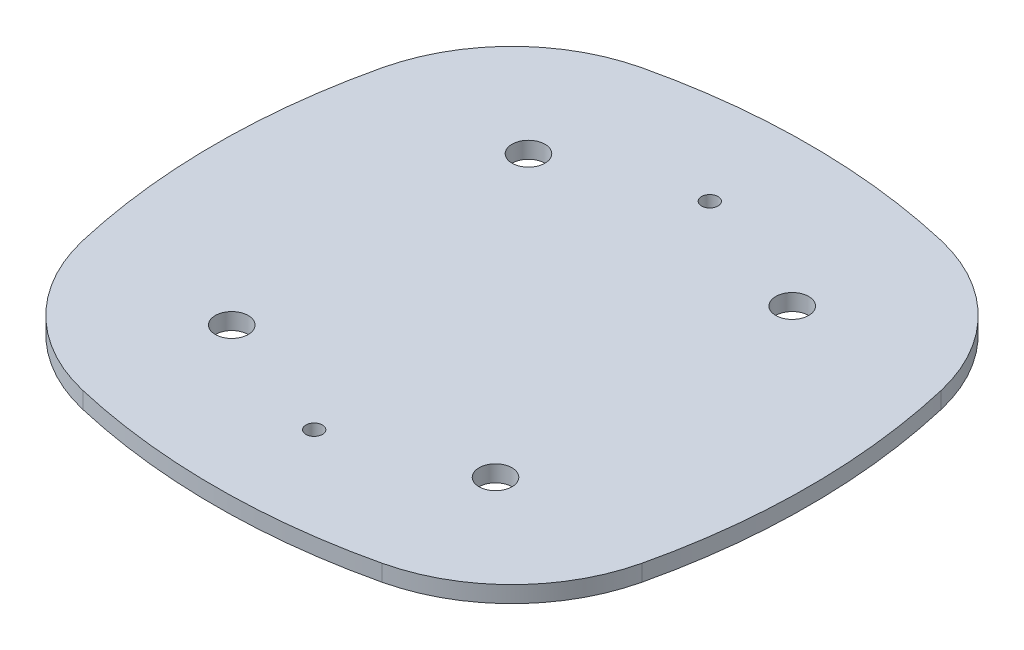
ISO-10303-21;
HEADER;
FILE_DESCRIPTION(('STEP AP214'),'2;1');
FILE_NAME('part.step','',(''),(''),'','','');
FILE_SCHEMA(('AUTOMOTIVE_DESIGN { 1 0 10303 214 1 1 1 1 }'));
ENDSEC;
DATA;
#1=APPLICATION_CONTEXT('core data for automotive mechanical design processes');
#2=APPLICATION_PROTOCOL_DEFINITION('international standard','automotive_design',2000,#1);
#3=PRODUCT_CONTEXT('',#1,'mechanical');
#4=PRODUCT('Part','Part','',(#3));
#5=PRODUCT_RELATED_PRODUCT_CATEGORY('part','',(#4));
#6=PRODUCT_DEFINITION_FORMATION('','',#4);
#7=PRODUCT_DEFINITION_CONTEXT('part definition',#1,'design');
#8=PRODUCT_DEFINITION('design','',#6,#7);
#9=PRODUCT_DEFINITION_SHAPE('','',#8);
#10=(LENGTH_UNIT() NAMED_UNIT(*) SI_UNIT(.MILLI.,.METRE.));
#11=(NAMED_UNIT(*) PLANE_ANGLE_UNIT() SI_UNIT($,.RADIAN.));
#12=(NAMED_UNIT(*) SI_UNIT($,.STERADIAN.) SOLID_ANGLE_UNIT());
#13=UNCERTAINTY_MEASURE_WITH_UNIT(LENGTH_MEASURE(1.E-05),#10,'distance_accuracy_value','');
#14=(GEOMETRIC_REPRESENTATION_CONTEXT(3) GLOBAL_UNCERTAINTY_ASSIGNED_CONTEXT((#13)) GLOBAL_UNIT_ASSIGNED_CONTEXT((#10,
#11,#12)) REPRESENTATION_CONTEXT('',''));
#15=CARTESIAN_POINT('',(0.,0.,0.));
#16=DIRECTION('',(0.,0.,1.));
#17=DIRECTION('',(1.,0.,0.));
#18=AXIS2_PLACEMENT_3D('',#15,#16,#17);
#19=CARTESIAN_POINT('',(-3.82916187310649,0.5,1.67083812689351));
#20=DIRECTION('',(0.,1.,0.));
#21=DIRECTION('',(0.,0.,1.));
#22=AXIS2_PLACEMENT_3D('',#19,#20,#21);
#23=PLANE('',#22);
#24=CARTESIAN_POINT('',(0.,0.5,-6.));
#25=DIRECTION('',(0.,1.,0.));
#26=DIRECTION('',(0.,0.,1.));
#27=AXIS2_PLACEMENT_3D('',#24,#25,#26);
#28=CIRCLE('',#27,0.25);
#29=CARTESIAN_POINT('',(0.,0.5,-5.75));
#30=VERTEX_POINT('',#29);
#31=EDGE_CURVE('E199',#30,#30,#28,.T.);
#32=ORIENTED_EDGE('',*,*,#31,.F.);
#33=EDGE_LOOP('',(#32));
#34=FACE_BOUND('',#33,.T.);
#35=CARTESIAN_POINT('',(4.,0.5,4.5));
#36=DIRECTION('',(0.,1.,0.));
#37=DIRECTION('',(0.,0.,1.));
#38=AXIS2_PLACEMENT_3D('',#35,#36,#37);
#39=CIRCLE('',#38,0.5);
#40=CARTESIAN_POINT('',(4.,0.5,5.));
#41=VERTEX_POINT('',#40);
#42=EDGE_CURVE('E187',#41,#41,#39,.T.);
#43=ORIENTED_EDGE('',*,*,#42,.F.);
#44=EDGE_LOOP('',(#43));
#45=FACE_BOUND('',#44,.T.);
#46=CARTESIAN_POINT('',(4.,0.5,-4.5));
#47=DIRECTION('',(0.,1.,0.));
#48=DIRECTION('',(0.,0.,1.));
#49=AXIS2_PLACEMENT_3D('',#46,#47,#48);
#50=CIRCLE('',#49,0.5);
#51=CARTESIAN_POINT('',(4.,0.5,-4.));
#52=VERTEX_POINT('',#51);
#53=EDGE_CURVE('E133',#52,#52,#50,.T.);
#54=ORIENTED_EDGE('',*,*,#53,.F.);
#55=EDGE_LOOP('',(#54));
#56=FACE_BOUND('',#55,.T.);
#57=CARTESIAN_POINT('',(3.34167625378701,0.5,3.34167625378702));
#58=DIRECTION('',(0.,1.,0.));
#59=DIRECTION('',(0.,0.,1.));
#60=AXIS2_PLACEMENT_3D('',#57,#58,#59);
#61=CIRCLE('',#60,5.27415612083428);
#62=CARTESIAN_POINT('',(4.53851919279799,0.5,8.47824025769793));
#63=VERTEX_POINT('',#62);
#64=CARTESIAN_POINT('',(8.47824025769793,0.5,4.53851919279798));
#65=VERTEX_POINT('',#64);
#66=EDGE_CURVE('E144',#63,#65,#61,.T.);
#67=ORIENTED_EDGE('',*,*,#66,.T.);
#68=CARTESIAN_POINT('',(-11.,0.5,0.));
#69=DIRECTION('',(0.,1.,0.));
#70=DIRECTION('',(0.,0.,1.));
#71=AXIS2_PLACEMENT_3D('',#68,#69,#70);
#72=CIRCLE('',#71,20.);
#73=CARTESIAN_POINT('',(8.47824025769793,0.5,-4.53851919279798));
#74=VERTEX_POINT('',#73);
#75=EDGE_CURVE('E92',#65,#74,#72,.T.);
#76=ORIENTED_EDGE('',*,*,#75,.T.);
#77=CARTESIAN_POINT('',(3.34167625378702,0.5,-3.34167625378701));
#78=DIRECTION('',(0.,1.,0.));
#79=DIRECTION('',(0.,0.,1.));
#80=AXIS2_PLACEMENT_3D('',#77,#78,#79);
#81=CIRCLE('',#80,5.27415612083428);
#82=CARTESIAN_POINT('',(4.53851919279798,0.5,-8.47824025769793));
#83=VERTEX_POINT('',#82);
#84=EDGE_CURVE('E159',#74,#83,#81,.T.);
#85=ORIENTED_EDGE('',*,*,#84,.T.);
#86=CARTESIAN_POINT('',(0.,0.5,11.));
#87=DIRECTION('',(0.,1.,0.));
#88=DIRECTION('',(0.,0.,1.));
#89=AXIS2_PLACEMENT_3D('',#86,#87,#88);
#90=CIRCLE('',#89,20.);
#91=CARTESIAN_POINT('',(-4.53851919279798,0.5,-8.47824025769793));
#92=VERTEX_POINT('',#91);
#93=EDGE_CURVE('E172',#83,#92,#90,.T.);
#94=ORIENTED_EDGE('',*,*,#93,.T.);
#95=CARTESIAN_POINT('',(-3.34167625378702,0.5,-3.34167625378701));
#96=DIRECTION('',(0.,1.,0.));
#97=DIRECTION('',(0.,0.,1.));
#98=AXIS2_PLACEMENT_3D('',#95,#96,#97);
#99=CIRCLE('',#98,5.27415612083428);
#100=CARTESIAN_POINT('',(-8.47824025769793,0.5,-4.53851919279798));
#101=VERTEX_POINT('',#100);
#102=EDGE_CURVE('E111',#92,#101,#99,.T.);
#103=ORIENTED_EDGE('',*,*,#102,.T.);
#104=CARTESIAN_POINT('',(11.,0.5,0.));
#105=DIRECTION('',(0.,1.,0.));
#106=DIRECTION('',(0.,0.,1.));
#107=AXIS2_PLACEMENT_3D('',#104,#105,#106);
#108=CIRCLE('',#107,20.);
#109=CARTESIAN_POINT('',(-8.47824025769792,0.5,4.538519192798));
#110=VERTEX_POINT('',#109);
#111=EDGE_CURVE('E105',#101,#110,#108,.T.);
#112=ORIENTED_EDGE('',*,*,#111,.T.);
#113=CARTESIAN_POINT('',(-3.34167625378704,0.5,3.34167625378705));
#114=DIRECTION('',(0.,1.,0.));
#115=DIRECTION('',(0.,0.,1.));
#116=AXIS2_PLACEMENT_3D('',#113,#114,#115);
#117=CIRCLE('',#116,5.27415612083425);
#118=CARTESIAN_POINT('',(-4.53851919279801,0.5,8.47824025769793));
#119=VERTEX_POINT('',#118);
#120=EDGE_CURVE('E109',#110,#119,#117,.T.);
#121=ORIENTED_EDGE('',*,*,#120,.T.);
#122=CARTESIAN_POINT('',(0.,0.5,-11.));
#123=DIRECTION('',(0.,1.,0.));
#124=DIRECTION('',(0.,0.,1.));
#125=AXIS2_PLACEMENT_3D('',#122,#123,#124);
#126=CIRCLE('',#125,20.);
#127=EDGE_CURVE('E49',#119,#63,#126,.T.);
#128=ORIENTED_EDGE('',*,*,#127,.T.);
#129=EDGE_LOOP('',(#67,#76,#85,#94,#103,#112,#121,#128));
#130=FACE_BOUND('',#129,.T.);
#131=CARTESIAN_POINT('',(-4.,0.5,-4.5));
#132=DIRECTION('',(0.,1.,0.));
#133=DIRECTION('',(0.,0.,1.));
#134=AXIS2_PLACEMENT_3D('',#131,#132,#133);
#135=CIRCLE('',#134,0.5);
#136=CARTESIAN_POINT('',(-4.,0.5,-4.));
#137=VERTEX_POINT('',#136);
#138=EDGE_CURVE('E181',#137,#137,#135,.T.);
#139=ORIENTED_EDGE('',*,*,#138,.F.);
#140=EDGE_LOOP('',(#139));
#141=FACE_BOUND('',#140,.T.);
#142=CARTESIAN_POINT('',(-4.,0.5,4.5));
#143=DIRECTION('',(0.,1.,0.));
#144=DIRECTION('',(0.,0.,1.));
#145=AXIS2_PLACEMENT_3D('',#142,#143,#144);
#146=CIRCLE('',#145,0.5);
#147=CARTESIAN_POINT('',(-4.,0.5,5.));
#148=VERTEX_POINT('',#147);
#149=EDGE_CURVE('E193',#148,#148,#146,.T.);
#150=ORIENTED_EDGE('',*,*,#149,.F.);
#151=EDGE_LOOP('',(#150));
#152=FACE_BOUND('',#151,.T.);
#153=CARTESIAN_POINT('',(0.,0.5,6.));
#154=DIRECTION('',(0.,1.,0.));
#155=DIRECTION('',(0.,0.,1.));
#156=AXIS2_PLACEMENT_3D('',#153,#154,#155);
#157=CIRCLE('',#156,0.25);
#158=CARTESIAN_POINT('',(0.,0.5,6.25));
#159=VERTEX_POINT('',#158);
#160=EDGE_CURVE('E205',#159,#159,#157,.T.);
#161=ORIENTED_EDGE('',*,*,#160,.F.);
#162=EDGE_LOOP('',(#161));
#163=FACE_BOUND('',#162,.T.);
#164=ADVANCED_FACE('F32',(#34,#45,#56,#130,#141,#152,#163),#23,.T.);
#165=CARTESIAN_POINT('',(-3.82916187310649,0.,1.67083812689351));
#166=DIRECTION('',(0.,1.,0.));
#167=DIRECTION('',(0.,0.,1.));
#168=AXIS2_PLACEMENT_3D('',#165,#166,#167);
#169=PLANE('',#168);
#170=CARTESIAN_POINT('',(0.,0.,-6.));
#171=DIRECTION('',(0.,1.,0.));
#172=DIRECTION('',(0.,0.,1.));
#173=AXIS2_PLACEMENT_3D('',#170,#171,#172);
#174=CIRCLE('',#173,0.25);
#175=CARTESIAN_POINT('',(0.,0.,-5.75));
#176=VERTEX_POINT('',#175);
#177=EDGE_CURVE('E202',#176,#176,#174,.T.);
#178=ORIENTED_EDGE('',*,*,#177,.T.);
#179=EDGE_LOOP('',(#178));
#180=FACE_BOUND('',#179,.T.);
#181=CARTESIAN_POINT('',(4.,0.,4.5));
#182=DIRECTION('',(0.,1.,0.));
#183=DIRECTION('',(0.,0.,1.));
#184=AXIS2_PLACEMENT_3D('',#181,#182,#183);
#185=CIRCLE('',#184,0.5);
#186=CARTESIAN_POINT('',(4.,0.,5.));
#187=VERTEX_POINT('',#186);
#188=EDGE_CURVE('E190',#187,#187,#185,.T.);
#189=ORIENTED_EDGE('',*,*,#188,.T.);
#190=EDGE_LOOP('',(#189));
#191=FACE_BOUND('',#190,.T.);
#192=CARTESIAN_POINT('',(4.,0.,-4.5));
#193=DIRECTION('',(0.,1.,0.));
#194=DIRECTION('',(0.,0.,1.));
#195=AXIS2_PLACEMENT_3D('',#192,#193,#194);
#196=CIRCLE('',#195,0.5);
#197=CARTESIAN_POINT('',(4.,0.,-4.));
#198=VERTEX_POINT('',#197);
#199=EDGE_CURVE('E178',#198,#198,#196,.T.);
#200=ORIENTED_EDGE('',*,*,#199,.T.);
#201=EDGE_LOOP('',(#200));
#202=FACE_BOUND('',#201,.T.);
#203=CARTESIAN_POINT('',(3.34167625378701,0.,3.34167625378702));
#204=DIRECTION('',(0.,1.,0.));
#205=DIRECTION('',(0.,0.,1.));
#206=AXIS2_PLACEMENT_3D('',#203,#204,#205);
#207=CIRCLE('',#206,5.27415612083428);
#208=CARTESIAN_POINT('',(4.53851919279799,0.,8.47824025769793));
#209=VERTEX_POINT('',#208);
#210=CARTESIAN_POINT('',(8.47824025769793,0.,4.53851919279798));
#211=VERTEX_POINT('',#210);
#212=EDGE_CURVE('E129',#209,#211,#207,.T.);
#213=ORIENTED_EDGE('',*,*,#212,.F.);
#214=CARTESIAN_POINT('',(0.,0.,-11.));
#215=DIRECTION('',(0.,1.,0.));
#216=DIRECTION('',(0.,0.,1.));
#217=AXIS2_PLACEMENT_3D('',#214,#215,#216);
#218=CIRCLE('',#217,20.);
#219=CARTESIAN_POINT('',(-4.53851919279801,0.,8.47824025769793));
#220=VERTEX_POINT('',#219);
#221=EDGE_CURVE('E84',#220,#209,#218,.T.);
#222=ORIENTED_EDGE('',*,*,#221,.F.);
#223=CARTESIAN_POINT('',(-3.34167625378704,0.,3.34167625378705));
#224=DIRECTION('',(0.,1.,0.));
#225=DIRECTION('',(0.,0.,1.));
#226=AXIS2_PLACEMENT_3D('',#223,#224,#225);
#227=CIRCLE('',#226,5.27415612083425);
#228=CARTESIAN_POINT('',(-8.47824025769792,0.,4.538519192798));
#229=VERTEX_POINT('',#228);
#230=EDGE_CURVE('E78',#229,#220,#227,.T.);
#231=ORIENTED_EDGE('',*,*,#230,.F.);
#232=CARTESIAN_POINT('',(11.,0.,0.));
#233=DIRECTION('',(0.,1.,0.));
#234=DIRECTION('',(0.,0.,1.));
#235=AXIS2_PLACEMENT_3D('',#232,#233,#234);
#236=CIRCLE('',#235,20.);
#237=CARTESIAN_POINT('',(-8.47824025769793,0.,-4.53851919279798));
#238=VERTEX_POINT('',#237);
#239=EDGE_CURVE('E119',#238,#229,#236,.T.);
#240=ORIENTED_EDGE('',*,*,#239,.F.);
#241=CARTESIAN_POINT('',(-3.34167625378702,0.,-3.34167625378701));
#242=DIRECTION('',(0.,1.,0.));
#243=DIRECTION('',(0.,0.,1.));
#244=AXIS2_PLACEMENT_3D('',#241,#242,#243);
#245=CIRCLE('',#244,5.27415612083428);
#246=CARTESIAN_POINT('',(-4.53851919279798,0.,-8.47824025769793));
#247=VERTEX_POINT('',#246);
#248=EDGE_CURVE('E139',#247,#238,#245,.T.);
#249=ORIENTED_EDGE('',*,*,#248,.F.);
#250=CARTESIAN_POINT('',(0.,0.,11.));
#251=DIRECTION('',(0.,1.,0.));
#252=DIRECTION('',(0.,0.,1.));
#253=AXIS2_PLACEMENT_3D('',#250,#251,#252);
#254=CIRCLE('',#253,20.);
#255=CARTESIAN_POINT('',(4.53851919279798,0.,-8.47824025769793));
#256=VERTEX_POINT('',#255);
#257=EDGE_CURVE('E137',#256,#247,#254,.T.);
#258=ORIENTED_EDGE('',*,*,#257,.F.);
#259=CARTESIAN_POINT('',(3.34167625378702,0.,-3.34167625378701));
#260=DIRECTION('',(0.,1.,0.));
#261=DIRECTION('',(0.,0.,1.));
#262=AXIS2_PLACEMENT_3D('',#259,#260,#261);
#263=CIRCLE('',#262,5.27415612083428);
#264=CARTESIAN_POINT('',(8.47824025769793,0.,-4.53851919279798));
#265=VERTEX_POINT('',#264);
#266=EDGE_CURVE('E135',#265,#256,#263,.T.);
#267=ORIENTED_EDGE('',*,*,#266,.F.);
#268=CARTESIAN_POINT('',(-11.,0.,0.));
#269=DIRECTION('',(0.,1.,0.));
#270=DIRECTION('',(0.,0.,1.));
#271=AXIS2_PLACEMENT_3D('',#268,#269,#270);
#272=CIRCLE('',#271,20.);
#273=EDGE_CURVE('E132',#211,#265,#272,.T.);
#274=ORIENTED_EDGE('',*,*,#273,.F.);
#275=EDGE_LOOP('',(#213,#222,#231,#240,#249,#258,#267,#274));
#276=FACE_BOUND('',#275,.T.);
#277=CARTESIAN_POINT('',(-4.,0.,-4.5));
#278=DIRECTION('',(0.,1.,0.));
#279=DIRECTION('',(0.,0.,1.));
#280=AXIS2_PLACEMENT_3D('',#277,#278,#279);
#281=CIRCLE('',#280,0.5);
#282=CARTESIAN_POINT('',(-4.,0.,-4.));
#283=VERTEX_POINT('',#282);
#284=EDGE_CURVE('E184',#283,#283,#281,.T.);
#285=ORIENTED_EDGE('',*,*,#284,.T.);
#286=EDGE_LOOP('',(#285));
#287=FACE_BOUND('',#286,.T.);
#288=CARTESIAN_POINT('',(-4.,0.,4.5));
#289=DIRECTION('',(0.,1.,0.));
#290=DIRECTION('',(0.,0.,1.));
#291=AXIS2_PLACEMENT_3D('',#288,#289,#290);
#292=CIRCLE('',#291,0.5);
#293=CARTESIAN_POINT('',(-4.,0.,5.));
#294=VERTEX_POINT('',#293);
#295=EDGE_CURVE('E196',#294,#294,#292,.T.);
#296=ORIENTED_EDGE('',*,*,#295,.T.);
#297=EDGE_LOOP('',(#296));
#298=FACE_BOUND('',#297,.T.);
#299=CARTESIAN_POINT('',(0.,0.,6.));
#300=DIRECTION('',(0.,1.,0.));
#301=DIRECTION('',(0.,0.,1.));
#302=AXIS2_PLACEMENT_3D('',#299,#300,#301);
#303=CIRCLE('',#302,0.25);
#304=CARTESIAN_POINT('',(0.,0.,6.25));
#305=VERTEX_POINT('',#304);
#306=EDGE_CURVE('E208',#305,#305,#303,.T.);
#307=ORIENTED_EDGE('',*,*,#306,.T.);
#308=EDGE_LOOP('',(#307));
#309=FACE_BOUND('',#308,.T.);
#310=ADVANCED_FACE('F163',(#180,#191,#202,#276,#287,#298,#309),#169,.F.);
#311=CARTESIAN_POINT('',(3.34167625378701,0.5,3.34167625378702));
#312=DIRECTION('',(0.,-1.,0.));
#313=DIRECTION('',(0.,0.,-1.));
#314=AXIS2_PLACEMENT_3D('',#311,#312,#313);
#315=CYLINDRICAL_SURFACE('',#314,5.27415612083428);
#316=ORIENTED_EDGE('',*,*,#212,.T.);
#317=DIRECTION('',(0.,-1.,0.));
#318=VECTOR('',#317,1.);
#319=CARTESIAN_POINT('',(8.47824025769793,0.5,4.53851919279798));
#320=LINE('',#319,#318);
#321=EDGE_CURVE('E11',#65,#211,#320,.T.);
#322=ORIENTED_EDGE('',*,*,#321,.F.);
#323=ORIENTED_EDGE('',*,*,#66,.F.);
#324=DIRECTION('',(0.,-1.,0.));
#325=VECTOR('',#324,1.);
#326=CARTESIAN_POINT('',(4.53851919279799,0.5,8.47824025769793));
#327=LINE('',#326,#325);
#328=EDGE_CURVE('E125',#63,#209,#327,.T.);
#329=ORIENTED_EDGE('',*,*,#328,.T.);
#330=EDGE_LOOP('',(#316,#322,#323,#329));
#331=FACE_BOUND('',#330,.T.);
#332=ADVANCED_FACE('F34',(#331),#315,.T.);
#333=CARTESIAN_POINT('',(-11.,0.5,0.));
#334=DIRECTION('',(0.,-1.,0.));
#335=DIRECTION('',(0.,0.,-1.));
#336=AXIS2_PLACEMENT_3D('',#333,#334,#335);
#337=CYLINDRICAL_SURFACE('',#336,20.);
#338=ORIENTED_EDGE('',*,*,#273,.T.);
#339=DIRECTION('',(0.,-1.,0.));
#340=VECTOR('',#339,1.);
#341=CARTESIAN_POINT('',(8.47824025769793,0.5,-4.53851919279798));
#342=LINE('',#341,#340);
#343=EDGE_CURVE('E41',#74,#265,#342,.T.);
#344=ORIENTED_EDGE('',*,*,#343,.F.);
#345=ORIENTED_EDGE('',*,*,#75,.F.);
#346=ORIENTED_EDGE('',*,*,#321,.T.);
#347=EDGE_LOOP('',(#338,#344,#345,#346));
#348=FACE_BOUND('',#347,.T.);
#349=ADVANCED_FACE('F243',(#348),#337,.T.);
#350=CARTESIAN_POINT('',(3.34167625378702,0.5,-3.34167625378701));
#351=DIRECTION('',(0.,-1.,0.));
#352=DIRECTION('',(0.,0.,-1.));
#353=AXIS2_PLACEMENT_3D('',#350,#351,#352);
#354=CYLINDRICAL_SURFACE('',#353,5.27415612083428);
#355=ORIENTED_EDGE('',*,*,#266,.T.);
#356=DIRECTION('',(0.,-1.,0.));
#357=VECTOR('',#356,1.);
#358=CARTESIAN_POINT('',(4.53851919279798,0.5,-8.47824025769793));
#359=LINE('',#358,#357);
#360=EDGE_CURVE('E151',#83,#256,#359,.T.);
#361=ORIENTED_EDGE('',*,*,#360,.F.);
#362=ORIENTED_EDGE('',*,*,#84,.F.);
#363=ORIENTED_EDGE('',*,*,#343,.T.);
#364=EDGE_LOOP('',(#355,#361,#362,#363));
#365=FACE_BOUND('',#364,.T.);
#366=ADVANCED_FACE('F157',(#365),#354,.T.);
#367=CARTESIAN_POINT('',(0.,0.5,11.));
#368=DIRECTION('',(0.,-1.,0.));
#369=DIRECTION('',(0.,0.,-1.));
#370=AXIS2_PLACEMENT_3D('',#367,#368,#369);
#371=CYLINDRICAL_SURFACE('',#370,20.);
#372=ORIENTED_EDGE('',*,*,#257,.T.);
#373=DIRECTION('',(0.,-1.,0.));
#374=VECTOR('',#373,1.);
#375=CARTESIAN_POINT('',(-4.53851919279798,0.5,-8.47824025769793));
#376=LINE('',#375,#374);
#377=EDGE_CURVE('E148',#92,#247,#376,.T.);
#378=ORIENTED_EDGE('',*,*,#377,.F.);
#379=ORIENTED_EDGE('',*,*,#93,.F.);
#380=ORIENTED_EDGE('',*,*,#360,.T.);
#381=EDGE_LOOP('',(#372,#378,#379,#380));
#382=FACE_BOUND('',#381,.T.);
#383=ADVANCED_FACE('F168',(#382),#371,.T.);
#384=CARTESIAN_POINT('',(-3.34167625378702,0.5,-3.34167625378701));
#385=DIRECTION('',(0.,-1.,0.));
#386=DIRECTION('',(0.,0.,-1.));
#387=AXIS2_PLACEMENT_3D('',#384,#385,#386);
#388=CYLINDRICAL_SURFACE('',#387,5.27415612083428);
#389=ORIENTED_EDGE('',*,*,#248,.T.);
#390=DIRECTION('',(0.,-1.,0.));
#391=VECTOR('',#390,1.);
#392=CARTESIAN_POINT('',(-8.47824025769793,0.5,-4.53851919279798));
#393=LINE('',#392,#391);
#394=EDGE_CURVE('E120',#101,#238,#393,.T.);
#395=ORIENTED_EDGE('',*,*,#394,.F.);
#396=ORIENTED_EDGE('',*,*,#102,.F.);
#397=ORIENTED_EDGE('',*,*,#377,.T.);
#398=EDGE_LOOP('',(#389,#395,#396,#397));
#399=FACE_BOUND('',#398,.T.);
#400=ADVANCED_FACE('F171',(#399),#388,.T.);
#401=CARTESIAN_POINT('',(11.,0.5,0.));
#402=DIRECTION('',(0.,-1.,0.));
#403=DIRECTION('',(0.,0.,-1.));
#404=AXIS2_PLACEMENT_3D('',#401,#402,#403);
#405=CYLINDRICAL_SURFACE('',#404,20.);
#406=ORIENTED_EDGE('',*,*,#239,.T.);
#407=DIRECTION('',(0.,-1.,0.));
#408=VECTOR('',#407,1.);
#409=CARTESIAN_POINT('',(-8.47824025769792,0.5,4.538519192798));
#410=LINE('',#409,#408);
#411=EDGE_CURVE('E116',#110,#229,#410,.T.);
#412=ORIENTED_EDGE('',*,*,#411,.F.);
#413=ORIENTED_EDGE('',*,*,#111,.F.);
#414=ORIENTED_EDGE('',*,*,#394,.T.);
#415=EDGE_LOOP('',(#406,#412,#413,#414));
#416=FACE_BOUND('',#415,.T.);
#417=ADVANCED_FACE('F117',(#416),#405,.T.);
#418=CARTESIAN_POINT('',(-3.34167625378704,0.5,3.34167625378705));
#419=DIRECTION('',(0.,-1.,0.));
#420=DIRECTION('',(0.,0.,-1.));
#421=AXIS2_PLACEMENT_3D('',#418,#419,#420);
#422=CYLINDRICAL_SURFACE('',#421,5.27415612083425);
#423=ORIENTED_EDGE('',*,*,#230,.T.);
#424=DIRECTION('',(0.,-1.,0.));
#425=VECTOR('',#424,1.);
#426=CARTESIAN_POINT('',(-4.53851919279801,0.5,8.47824025769793));
#427=LINE('',#426,#425);
#428=EDGE_CURVE('E121',#119,#220,#427,.T.);
#429=ORIENTED_EDGE('',*,*,#428,.F.);
#430=ORIENTED_EDGE('',*,*,#120,.F.);
#431=ORIENTED_EDGE('',*,*,#411,.T.);
#432=EDGE_LOOP('',(#423,#429,#430,#431));
#433=FACE_BOUND('',#432,.T.);
#434=ADVANCED_FACE('F123',(#433),#422,.T.);
#435=CARTESIAN_POINT('',(0.,0.5,-11.));
#436=DIRECTION('',(0.,-1.,0.));
#437=DIRECTION('',(0.,0.,-1.));
#438=AXIS2_PLACEMENT_3D('',#435,#436,#437);
#439=CYLINDRICAL_SURFACE('',#438,20.);
#440=ORIENTED_EDGE('',*,*,#221,.T.);
#441=ORIENTED_EDGE('',*,*,#328,.F.);
#442=ORIENTED_EDGE('',*,*,#127,.F.);
#443=ORIENTED_EDGE('',*,*,#428,.T.);
#444=EDGE_LOOP('',(#440,#441,#442,#443));
#445=FACE_BOUND('',#444,.T.);
#446=ADVANCED_FACE('F231',(#445),#439,.T.);
#447=CARTESIAN_POINT('',(4.,0.5,-4.5));
#448=DIRECTION('',(0.,-1.,0.));
#449=DIRECTION('',(0.,0.,-1.));
#450=AXIS2_PLACEMENT_3D('',#447,#448,#449);
#451=CYLINDRICAL_SURFACE('',#450,0.5);
#452=ORIENTED_EDGE('',*,*,#53,.T.);
#453=EDGE_LOOP('',(#452));
#454=FACE_BOUND('',#453,.T.);
#455=ORIENTED_EDGE('',*,*,#199,.F.);
#456=EDGE_LOOP('',(#455));
#457=FACE_BOUND('',#456,.T.);
#458=ADVANCED_FACE('F228',(#454,#457),#451,.F.);
#459=CARTESIAN_POINT('',(-4.,0.5,-4.5));
#460=DIRECTION('',(0.,-1.,0.));
#461=DIRECTION('',(0.,0.,-1.));
#462=AXIS2_PLACEMENT_3D('',#459,#460,#461);
#463=CYLINDRICAL_SURFACE('',#462,0.5);
#464=ORIENTED_EDGE('',*,*,#138,.T.);
#465=EDGE_LOOP('',(#464));
#466=FACE_BOUND('',#465,.T.);
#467=ORIENTED_EDGE('',*,*,#284,.F.);
#468=EDGE_LOOP('',(#467));
#469=FACE_BOUND('',#468,.T.);
#470=ADVANCED_FACE('F307',(#466,#469),#463,.F.);
#471=CARTESIAN_POINT('',(4.,0.5,4.5));
#472=DIRECTION('',(0.,-1.,0.));
#473=DIRECTION('',(0.,0.,-1.));
#474=AXIS2_PLACEMENT_3D('',#471,#472,#473);
#475=CYLINDRICAL_SURFACE('',#474,0.5);
#476=ORIENTED_EDGE('',*,*,#42,.T.);
#477=EDGE_LOOP('',(#476));
#478=FACE_BOUND('',#477,.T.);
#479=ORIENTED_EDGE('',*,*,#188,.F.);
#480=EDGE_LOOP('',(#479));
#481=FACE_BOUND('',#480,.T.);
#482=ADVANCED_FACE('F315',(#478,#481),#475,.F.);
#483=CARTESIAN_POINT('',(-4.,0.5,4.5));
#484=DIRECTION('',(0.,-1.,0.));
#485=DIRECTION('',(0.,0.,-1.));
#486=AXIS2_PLACEMENT_3D('',#483,#484,#485);
#487=CYLINDRICAL_SURFACE('',#486,0.5);
#488=ORIENTED_EDGE('',*,*,#149,.T.);
#489=EDGE_LOOP('',(#488));
#490=FACE_BOUND('',#489,.T.);
#491=ORIENTED_EDGE('',*,*,#295,.F.);
#492=EDGE_LOOP('',(#491));
#493=FACE_BOUND('',#492,.T.);
#494=ADVANCED_FACE('F323',(#490,#493),#487,.F.);
#495=CARTESIAN_POINT('',(0.,0.5,-6.));
#496=DIRECTION('',(0.,-1.,0.));
#497=DIRECTION('',(0.,0.,-1.));
#498=AXIS2_PLACEMENT_3D('',#495,#496,#497);
#499=CYLINDRICAL_SURFACE('',#498,0.25);
#500=ORIENTED_EDGE('',*,*,#31,.T.);
#501=EDGE_LOOP('',(#500));
#502=FACE_BOUND('',#501,.T.);
#503=ORIENTED_EDGE('',*,*,#177,.F.);
#504=EDGE_LOOP('',(#503));
#505=FACE_BOUND('',#504,.T.);
#506=ADVANCED_FACE('F332',(#502,#505),#499,.F.);
#507=CARTESIAN_POINT('',(0.,0.5,6.));
#508=DIRECTION('',(0.,-1.,0.));
#509=DIRECTION('',(0.,0.,-1.));
#510=AXIS2_PLACEMENT_3D('',#507,#508,#509);
#511=CYLINDRICAL_SURFACE('',#510,0.25);
#512=ORIENTED_EDGE('',*,*,#160,.T.);
#513=EDGE_LOOP('',(#512));
#514=FACE_BOUND('',#513,.T.);
#515=ORIENTED_EDGE('',*,*,#306,.F.);
#516=EDGE_LOOP('',(#515));
#517=FACE_BOUND('',#516,.T.);
#518=ADVANCED_FACE('F214',(#514,#517),#511,.F.);
#519=CLOSED_SHELL('',(#164,#310,#332,#349,#366,#383,#400,#417,#434,#446,#458,#470,#482,#494,
#506,#518));
#520=MANIFOLD_SOLID_BREP('B2',#519);
#521=ADVANCED_BREP_SHAPE_REPRESENTATION('',(#18,#520),#14);
#522=SHAPE_DEFINITION_REPRESENTATION(#9,#521);
ENDSEC;
END-ISO-10303-21;
